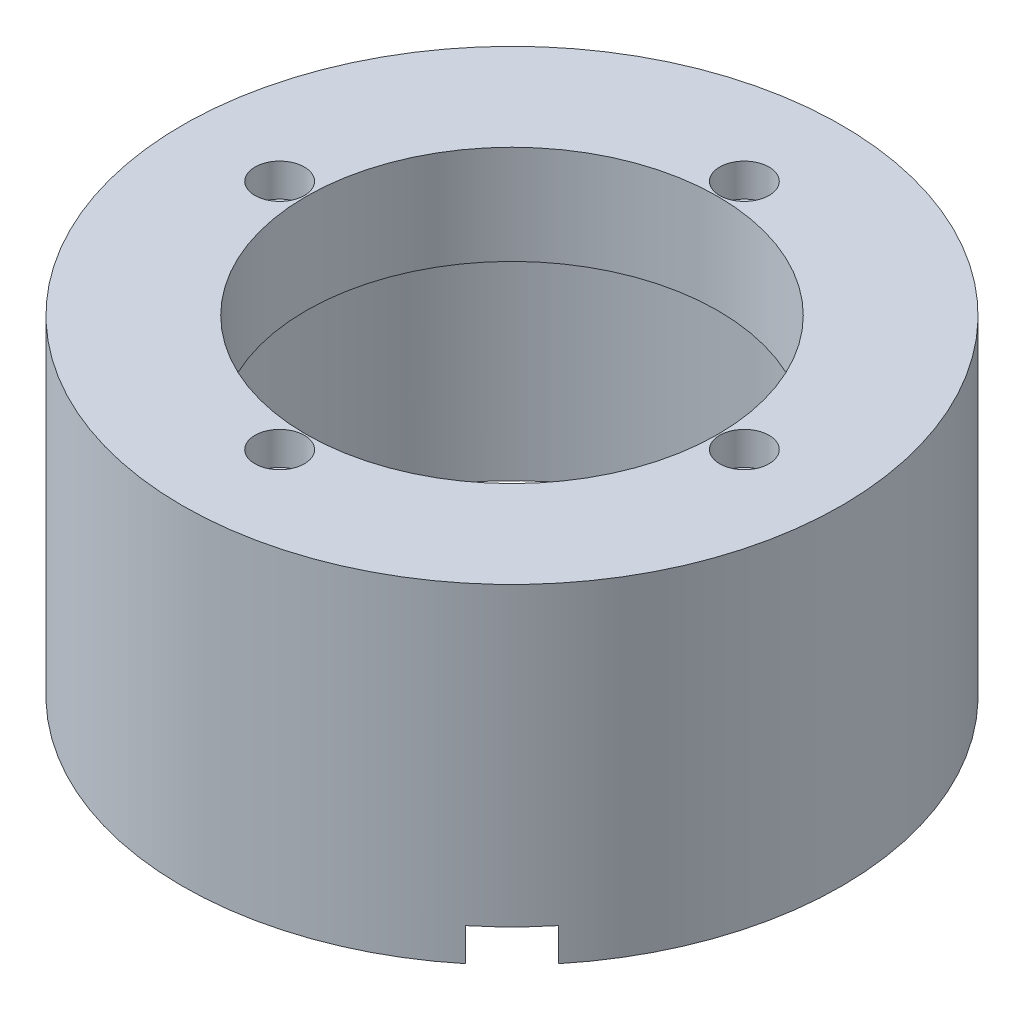
ISO-10303-21;
HEADER;
FILE_DESCRIPTION(('STEP AP214'),'2;1');
FILE_NAME('part.step','',(''),(''),'','','');
FILE_SCHEMA(('AUTOMOTIVE_DESIGN { 1 0 10303 214 1 1 1 1 }'));
ENDSEC;
DATA;
#1=APPLICATION_CONTEXT('core data for automotive mechanical design processes');
#2=APPLICATION_PROTOCOL_DEFINITION('international standard','automotive_design',2000,#1);
#3=PRODUCT_CONTEXT('',#1,'mechanical');
#4=PRODUCT('Part','Part','',(#3));
#5=PRODUCT_RELATED_PRODUCT_CATEGORY('part','',(#4));
#6=PRODUCT_DEFINITION_FORMATION('','',#4);
#7=PRODUCT_DEFINITION_CONTEXT('part definition',#1,'design');
#8=PRODUCT_DEFINITION('design','',#6,#7);
#9=PRODUCT_DEFINITION_SHAPE('','',#8);
#10=(LENGTH_UNIT() NAMED_UNIT(*) SI_UNIT(.MILLI.,.METRE.));
#11=(NAMED_UNIT(*) PLANE_ANGLE_UNIT() SI_UNIT($,.RADIAN.));
#12=(NAMED_UNIT(*) SI_UNIT($,.STERADIAN.) SOLID_ANGLE_UNIT());
#13=UNCERTAINTY_MEASURE_WITH_UNIT(LENGTH_MEASURE(1.E-05),#10,'distance_accuracy_value','');
#14=(GEOMETRIC_REPRESENTATION_CONTEXT(3) GLOBAL_UNCERTAINTY_ASSIGNED_CONTEXT((#13)) GLOBAL_UNIT_ASSIGNED_CONTEXT((#10,
#11,#12)) REPRESENTATION_CONTEXT('',''));
#15=CARTESIAN_POINT('',(0.,0.,0.));
#16=DIRECTION('',(0.,0.,1.));
#17=DIRECTION('',(1.,0.,0.));
#18=AXIS2_PLACEMENT_3D('',#15,#16,#17);
#19=CARTESIAN_POINT('',(0.,0.,0.));
#20=DIRECTION('',(0.,1.,0.));
#21=DIRECTION('',(0.,0.,1.));
#22=AXIS2_PLACEMENT_3D('',#19,#20,#21);
#23=PLANE('',#22);
#24=CARTESIAN_POINT('',(45.0000000000022,0.,2.25047696454651E-12));
#25=DIRECTION('',(0.,-1.,0.));
#26=DIRECTION('',(0.,0.,-1.));
#27=AXIS2_PLACEMENT_3D('',#24,#25,#26);
#28=CIRCLE('',#27,1.50000000000164);
#29=CARTESIAN_POINT('',(45.0000000000022,0.,-1.49999999999939));
#30=VERTEX_POINT('',#29);
#31=EDGE_CURVE('E144',#30,#30,#28,.T.);
#32=ORIENTED_EDGE('',*,*,#31,.F.);
#33=EDGE_LOOP('',(#32));
#34=FACE_BOUND('',#33,.T.);
#35=CARTESIAN_POINT('',(-44.9999999999977,0.,-2.25598787514267E-12));
#36=DIRECTION('',(0.,-1.,0.));
#37=DIRECTION('',(0.,0.,-1.));
#38=AXIS2_PLACEMENT_3D('',#35,#36,#37);
#39=CIRCLE('',#38,1.50000000000327);
#40=CARTESIAN_POINT('',(-44.9999999999977,0.,-1.50000000000552));
#41=VERTEX_POINT('',#40);
#42=EDGE_CURVE('E138',#41,#41,#39,.T.);
#43=ORIENTED_EDGE('',*,*,#42,.F.);
#44=EDGE_LOOP('',(#43));
#45=FACE_BOUND('',#44,.T.);
#46=CARTESIAN_POINT('',(0.,0.,45.));
#47=DIRECTION('',(0.,-1.,0.));
#48=DIRECTION('',(0.,0.,-1.));
#49=AXIS2_PLACEMENT_3D('',#46,#47,#48);
#50=CIRCLE('',#49,1.5);
#51=CARTESIAN_POINT('',(0.,0.,43.5));
#52=VERTEX_POINT('',#51);
#53=EDGE_CURVE('E132',#52,#52,#50,.T.);
#54=ORIENTED_EDGE('',*,*,#53,.F.);
#55=EDGE_LOOP('',(#54));
#56=FACE_BOUND('',#55,.T.);
#57=CARTESIAN_POINT('',(4.50095392909302E-12,0.,-45.));
#58=DIRECTION('',(0.,-1.,0.));
#59=DIRECTION('',(0.,0.,-1.));
#60=AXIS2_PLACEMENT_3D('',#57,#58,#59);
#61=CIRCLE('',#60,1.50000000000461);
#62=CARTESIAN_POINT('',(4.50095392909302E-12,0.,-46.5000000000046));
#63=VERTEX_POINT('',#62);
#64=EDGE_CURVE('E129',#63,#63,#61,.T.);
#65=ORIENTED_EDGE('',*,*,#64,.F.);
#66=EDGE_LOOP('',(#65));
#67=FACE_BOUND('',#66,.T.);
#68=DIRECTION('',(-0.707106781186546,0.,-0.707106781186549));
#69=VECTOR('',#68,1.);
#70=CARTESIAN_POINT('',(3.53553390593275,0.,-3.53553390593273));
#71=LINE('',#70,#69);
#72=CARTESIAN_POINT('',(38.7136521046084,0.,31.6425842927431));
#73=VERTEX_POINT('',#72);
#74=CARTESIAN_POINT('',(31.5979643067373,0.,24.5268964948719));
#75=VERTEX_POINT('',#74);
#76=EDGE_CURVE('E75',#73,#75,#71,.T.);
#77=ORIENTED_EDGE('',*,*,#76,.T.);
#78=CARTESIAN_POINT('',(0.,0.,0.));
#79=DIRECTION('',(0.,-1.,0.));
#80=DIRECTION('',(0.,0.,-1.));
#81=AXIS2_PLACEMENT_3D('',#78,#79,#80);
#82=CIRCLE('',#81,40.);
#83=CARTESIAN_POINT('',(24.5268964948718,0.,31.5979643067373));
#84=VERTEX_POINT('',#83);
#85=EDGE_CURVE('E128',#84,#75,#82,.T.);
#86=ORIENTED_EDGE('',*,*,#85,.F.);
#87=DIRECTION('',(-0.707106781186547,0.,-0.707106781186548));
#88=VECTOR('',#87,1.);
#89=CARTESIAN_POINT('',(-3.53553390593276,0.,3.53553390593275));
#90=LINE('',#89,#88);
#91=CARTESIAN_POINT('',(31.6425842927429,0.,38.7136521046085));
#92=VERTEX_POINT('',#91);
#93=EDGE_CURVE('E268',#92,#84,#90,.T.);
#94=ORIENTED_EDGE('',*,*,#93,.F.);
#95=CARTESIAN_POINT('',(0.,0.,0.));
#96=DIRECTION('',(0.,1.,0.));
#97=DIRECTION('',(0.,0.,1.));
#98=AXIS2_PLACEMENT_3D('',#95,#96,#97);
#99=CIRCLE('',#98,50.);
#100=EDGE_CURVE('E42',#73,#92,#99,.T.);
#101=ORIENTED_EDGE('',*,*,#100,.F.);
#102=EDGE_LOOP('',(#77,#86,#94,#101));
#103=FACE_BOUND('',#102,.T.);
#104=ADVANCED_FACE('F33',(#34,#45,#56,#67,#103),#23,.F.);
#105=CARTESIAN_POINT('',(0.,50.,0.));
#106=DIRECTION('',(0.,-1.,0.));
#107=DIRECTION('',(0.,0.,-1.));
#108=AXIS2_PLACEMENT_3D('',#105,#106,#107);
#109=CYLINDRICAL_SURFACE('',#108,50.);
#110=CARTESIAN_POINT('',(0.,50.,0.));
#111=DIRECTION('',(0.,1.,0.));
#112=DIRECTION('',(0.,0.,1.));
#113=AXIS2_PLACEMENT_3D('',#110,#111,#112);
#114=CIRCLE('',#113,50.);
#115=CARTESIAN_POINT('',(0.,50.,50.));
#116=VERTEX_POINT('',#115);
#117=EDGE_CURVE('E11',#116,#116,#114,.T.);
#118=ORIENTED_EDGE('',*,*,#117,.F.);
#119=EDGE_LOOP('',(#118));
#120=FACE_BOUND('',#119,.T.);
#121=DIRECTION('',(0.,-1.,0.));
#122=VECTOR('',#121,1.);
#123=CARTESIAN_POINT('',(38.7136521046084,5.,31.6425842927431));
#124=LINE('',#123,#122);
#125=CARTESIAN_POINT('',(38.7136521046084,5.,31.6425842927431));
#126=VERTEX_POINT('',#125);
#127=EDGE_CURVE('E59',#126,#73,#124,.T.);
#128=ORIENTED_EDGE('',*,*,#127,.T.);
#129=ORIENTED_EDGE('',*,*,#100,.T.);
#130=DIRECTION('',(0.,-1.,0.));
#131=VECTOR('',#130,1.);
#132=CARTESIAN_POINT('',(31.6425842927429,5.,38.7136521046085));
#133=LINE('',#132,#131);
#134=CARTESIAN_POINT('',(31.6425842927429,5.,38.7136521046085));
#135=VERTEX_POINT('',#134);
#136=EDGE_CURVE('E79',#135,#92,#133,.T.);
#137=ORIENTED_EDGE('',*,*,#136,.F.);
#138=CARTESIAN_POINT('',(0.,5.,0.));
#139=DIRECTION('',(0.,-1.,0.));
#140=DIRECTION('',(0.,0.,-1.));
#141=AXIS2_PLACEMENT_3D('',#138,#139,#140);
#142=CIRCLE('',#141,50.);
#143=EDGE_CURVE('E85',#126,#135,#142,.T.);
#144=ORIENTED_EDGE('',*,*,#143,.F.);
#145=EDGE_LOOP('',(#128,#129,#137,#144));
#146=FACE_BOUND('',#145,.T.);
#147=ADVANCED_FACE('F35',(#120,#146),#109,.T.);
#148=CARTESIAN_POINT('',(0.,35.,0.));
#149=DIRECTION('',(0.,-1.,0.));
#150=DIRECTION('',(0.,0.,-1.));
#151=AXIS2_PLACEMENT_3D('',#148,#149,#150);
#152=CYLINDRICAL_SURFACE('',#151,40.);
#153=CARTESIAN_POINT('',(0.,35.,0.));
#154=DIRECTION('',(0.,-1.,0.));
#155=DIRECTION('',(0.,0.,-1.));
#156=AXIS2_PLACEMENT_3D('',#153,#154,#155);
#157=CIRCLE('',#156,40.);
#158=CARTESIAN_POINT('',(0.,35.,-40.));
#159=VERTEX_POINT('',#158);
#160=EDGE_CURVE('E151',#159,#159,#157,.T.);
#161=ORIENTED_EDGE('',*,*,#160,.F.);
#162=EDGE_LOOP('',(#161));
#163=FACE_BOUND('',#162,.T.);
#164=DIRECTION('',(0.,-1.,0.));
#165=VECTOR('',#164,1.);
#166=CARTESIAN_POINT('',(31.5979643067373,5.,24.5268964948719));
#167=LINE('',#166,#165);
#168=CARTESIAN_POINT('',(31.5979643067373,5.,24.5268964948719));
#169=VERTEX_POINT('',#168);
#170=EDGE_CURVE('E95',#169,#75,#167,.T.);
#171=ORIENTED_EDGE('',*,*,#170,.F.);
#172=CARTESIAN_POINT('',(0.,5.,0.));
#173=DIRECTION('',(0.,-1.,0.));
#174=DIRECTION('',(0.,0.,-1.));
#175=AXIS2_PLACEMENT_3D('',#172,#173,#174);
#176=CIRCLE('',#175,40.);
#177=CARTESIAN_POINT('',(24.5268964948718,5.,31.5979643067373));
#178=VERTEX_POINT('',#177);
#179=EDGE_CURVE('E84',#178,#169,#176,.F.);
#180=ORIENTED_EDGE('',*,*,#179,.F.);
#181=DIRECTION('',(0.,-1.,0.));
#182=VECTOR('',#181,1.);
#183=CARTESIAN_POINT('',(24.5268964948718,5.,31.5979643067373));
#184=LINE('',#183,#182);
#185=EDGE_CURVE('E82',#178,#84,#184,.T.);
#186=ORIENTED_EDGE('',*,*,#185,.T.);
#187=ORIENTED_EDGE('',*,*,#85,.T.);
#188=EDGE_LOOP('',(#171,#180,#186,#187));
#189=FACE_BOUND('',#188,.T.);
#190=ADVANCED_FACE('F190',(#163,#189),#152,.F.);
#191=CARTESIAN_POINT('',(-35.2499999999977,50.,-2.25419682919892E-12));
#192=DIRECTION('',(0.,-1.,0.));
#193=DIRECTION('',(0.,0.,-1.));
#194=AXIS2_PLACEMENT_3D('',#191,#192,#193);
#195=CYLINDRICAL_SURFACE('',#194,2.00000000000317);
#196=CARTESIAN_POINT('',(-35.2499999999977,35.,-2.25419682919892E-12));
#197=DIRECTION('',(0.,-1.,0.));
#198=DIRECTION('',(0.,0.,-1.));
#199=AXIS2_PLACEMENT_3D('',#196,#197,#198);
#200=CIRCLE('',#199,2.00000000000317);
#201=CARTESIAN_POINT('',(-35.2499999999977,35.,-2.00000000000542));
#202=VERTEX_POINT('',#201);
#203=EDGE_CURVE('E163',#202,#202,#200,.T.);
#204=ORIENTED_EDGE('',*,*,#203,.T.);
#205=EDGE_LOOP('',(#204));
#206=FACE_BOUND('',#205,.T.);
#207=CARTESIAN_POINT('',(-35.2499999999977,45.,-2.25419682919892E-12));
#208=DIRECTION('',(0.,1.,0.));
#209=DIRECTION('',(0.,0.,1.));
#210=AXIS2_PLACEMENT_3D('',#207,#208,#209);
#211=CIRCLE('',#210,2.00000000000317);
#212=CARTESIAN_POINT('',(-35.2499999999977,45.,2.00000000000091));
#213=VERTEX_POINT('',#212);
#214=EDGE_CURVE('E37',#213,#213,#211,.F.);
#215=ORIENTED_EDGE('',*,*,#214,.F.);
#216=EDGE_LOOP('',(#215));
#217=FACE_BOUND('',#216,.T.);
#218=ADVANCED_FACE('F187',(#206,#217),#195,.F.);
#219=CARTESIAN_POINT('',(4.49975989846385E-12,50.,-35.25));
#220=DIRECTION('',(0.,-1.,0.));
#221=DIRECTION('',(0.,0.,-1.));
#222=AXIS2_PLACEMENT_3D('',#219,#220,#221);
#223=CYLINDRICAL_SURFACE('',#222,2.00000000000454);
#224=CARTESIAN_POINT('',(4.49975989846385E-12,35.,-35.25));
#225=DIRECTION('',(0.,-1.,0.));
#226=DIRECTION('',(0.,0.,-1.));
#227=AXIS2_PLACEMENT_3D('',#224,#225,#226);
#228=CIRCLE('',#227,2.00000000000454);
#229=CARTESIAN_POINT('',(4.49975989846385E-12,35.,-37.2500000000045));
#230=VERTEX_POINT('',#229);
#231=EDGE_CURVE('E166',#230,#230,#228,.T.);
#232=ORIENTED_EDGE('',*,*,#231,.T.);
#233=EDGE_LOOP('',(#232));
#234=FACE_BOUND('',#233,.T.);
#235=CARTESIAN_POINT('',(4.49975989846385E-12,45.,-35.25));
#236=DIRECTION('',(0.,1.,0.));
#237=DIRECTION('',(0.,0.,1.));
#238=AXIS2_PLACEMENT_3D('',#235,#236,#237);
#239=CIRCLE('',#238,2.00000000000454);
#240=CARTESIAN_POINT('',(4.49975989846385E-12,45.,-33.2499999999955));
#241=VERTEX_POINT('',#240);
#242=EDGE_CURVE('E178',#241,#241,#239,.F.);
#243=ORIENTED_EDGE('',*,*,#242,.F.);
#244=EDGE_LOOP('',(#243));
#245=FACE_BOUND('',#244,.T.);
#246=ADVANCED_FACE('F189',(#234,#245),#223,.F.);
#247=CARTESIAN_POINT('',(35.2500000000022,50.,2.24987994923192E-12));
#248=DIRECTION('',(0.,-1.,0.));
#249=DIRECTION('',(0.,0.,-1.));
#250=AXIS2_PLACEMENT_3D('',#247,#248,#249);
#251=CYLINDRICAL_SURFACE('',#250,2.00000000000161);
#252=CARTESIAN_POINT('',(35.2500000000022,35.,2.24987994923192E-12));
#253=DIRECTION('',(0.,-1.,0.));
#254=DIRECTION('',(0.,0.,-1.));
#255=AXIS2_PLACEMENT_3D('',#252,#253,#254);
#256=CIRCLE('',#255,2.00000000000161);
#257=CARTESIAN_POINT('',(35.2500000000022,35.,-1.99999999999936));
#258=VERTEX_POINT('',#257);
#259=EDGE_CURVE('E169',#258,#258,#256,.T.);
#260=ORIENTED_EDGE('',*,*,#259,.T.);
#261=EDGE_LOOP('',(#260));
#262=FACE_BOUND('',#261,.T.);
#263=CARTESIAN_POINT('',(35.2500000000022,45.,2.24987994923192E-12));
#264=DIRECTION('',(0.,1.,0.));
#265=DIRECTION('',(0.,0.,1.));
#266=AXIS2_PLACEMENT_3D('',#263,#264,#265);
#267=CIRCLE('',#266,2.00000000000161);
#268=CARTESIAN_POINT('',(35.2500000000022,45.,2.00000000000386));
#269=VERTEX_POINT('',#268);
#270=EDGE_CURVE('E176',#269,#269,#267,.F.);
#271=ORIENTED_EDGE('',*,*,#270,.F.);
#272=EDGE_LOOP('',(#271));
#273=FACE_BOUND('',#272,.T.);
#274=ADVANCED_FACE('F197',(#262,#273),#251,.F.);
#275=CARTESIAN_POINT('',(0.,50.,35.25));
#276=DIRECTION('',(0.,-1.,0.));
#277=DIRECTION('',(0.,0.,-1.));
#278=AXIS2_PLACEMENT_3D('',#275,#276,#277);
#279=CYLINDRICAL_SURFACE('',#278,2.);
#280=CARTESIAN_POINT('',(0.,35.,35.25));
#281=DIRECTION('',(0.,-1.,0.));
#282=DIRECTION('',(0.,0.,-1.));
#283=AXIS2_PLACEMENT_3D('',#280,#281,#282);
#284=CIRCLE('',#283,2.);
#285=CARTESIAN_POINT('',(0.,35.,33.25));
#286=VERTEX_POINT('',#285);
#287=EDGE_CURVE('E150',#286,#286,#284,.T.);
#288=ORIENTED_EDGE('',*,*,#287,.T.);
#289=EDGE_LOOP('',(#288));
#290=FACE_BOUND('',#289,.T.);
#291=CARTESIAN_POINT('',(0.,45.,35.25));
#292=DIRECTION('',(0.,1.,0.));
#293=DIRECTION('',(0.,0.,1.));
#294=AXIS2_PLACEMENT_3D('',#291,#292,#293);
#295=CIRCLE('',#294,2.);
#296=CARTESIAN_POINT('',(0.,45.,37.25));
#297=VERTEX_POINT('',#296);
#298=EDGE_CURVE('E103',#297,#297,#295,.F.);
#299=ORIENTED_EDGE('',*,*,#298,.F.);
#300=EDGE_LOOP('',(#299));
#301=FACE_BOUND('',#300,.T.);
#302=ADVANCED_FACE('F219',(#290,#301),#279,.F.);
#303=CARTESIAN_POINT('',(0.,50.,0.));
#304=DIRECTION('',(0.,-1.,0.));
#305=DIRECTION('',(0.,0.,-1.));
#306=AXIS2_PLACEMENT_3D('',#303,#304,#305);
#307=CYLINDRICAL_SURFACE('',#306,31.25);
#308=CARTESIAN_POINT('',(0.,50.,0.));
#309=DIRECTION('',(0.,1.,0.));
#310=DIRECTION('',(0.,0.,1.));
#311=AXIS2_PLACEMENT_3D('',#308,#309,#310);
#312=CIRCLE('',#311,31.25);
#313=CARTESIAN_POINT('',(0.,50.,31.25));
#314=VERTEX_POINT('',#313);
#315=EDGE_CURVE('E157',#314,#314,#312,.T.);
#316=ORIENTED_EDGE('',*,*,#315,.T.);
#317=EDGE_LOOP('',(#316));
#318=FACE_BOUND('',#317,.T.);
#319=CARTESIAN_POINT('',(0.,35.,0.));
#320=DIRECTION('',(0.,-1.,0.));
#321=DIRECTION('',(0.,0.,-1.));
#322=AXIS2_PLACEMENT_3D('',#319,#320,#321);
#323=CIRCLE('',#322,31.25);
#324=CARTESIAN_POINT('',(0.,35.,-31.25));
#325=VERTEX_POINT('',#324);
#326=EDGE_CURVE('E154',#325,#325,#323,.T.);
#327=ORIENTED_EDGE('',*,*,#326,.T.);
#328=EDGE_LOOP('',(#327));
#329=FACE_BOUND('',#328,.T.);
#330=ADVANCED_FACE('F216',(#318,#329),#307,.F.);
#331=CARTESIAN_POINT('',(0.,50.,0.));
#332=DIRECTION('',(0.,1.,0.));
#333=DIRECTION('',(0.,0.,1.));
#334=AXIS2_PLACEMENT_3D('',#331,#332,#333);
#335=PLANE('',#334);
#336=CARTESIAN_POINT('',(4.49975989846385E-12,50.,-35.25));
#337=DIRECTION('',(0.,1.,0.));
#338=DIRECTION('',(0.,0.,1.));
#339=AXIS2_PLACEMENT_3D('',#336,#337,#338);
#340=CIRCLE('',#339,3.75);
#341=CARTESIAN_POINT('',(4.49975989846385E-12,50.,-31.5));
#342=VERTEX_POINT('',#341);
#343=EDGE_CURVE('E104',#342,#342,#340,.T.);
#344=ORIENTED_EDGE('',*,*,#343,.F.);
#345=EDGE_LOOP('',(#344));
#346=FACE_BOUND('',#345,.T.);
#347=CARTESIAN_POINT('',(35.250000000001,50.,3.51084528094309E-12));
#348=DIRECTION('',(0.,1.,0.));
#349=DIRECTION('',(0.,0.,1.));
#350=AXIS2_PLACEMENT_3D('',#347,#348,#349);
#351=CIRCLE('',#350,3.75000000000078);
#352=CARTESIAN_POINT('',(35.250000000001,50.,3.75000000000429));
#353=VERTEX_POINT('',#352);
#354=EDGE_CURVE('E110',#353,#353,#351,.T.);
#355=ORIENTED_EDGE('',*,*,#354,.F.);
#356=EDGE_LOOP('',(#355));
#357=FACE_BOUND('',#356,.T.);
#358=CARTESIAN_POINT('',(-2.52193066342233E-12,50.,35.25));
#359=DIRECTION('',(0.,1.,0.));
#360=DIRECTION('',(0.,0.,1.));
#361=AXIS2_PLACEMENT_3D('',#358,#359,#360);
#362=CIRCLE('',#361,3.75000000000213);
#363=CARTESIAN_POINT('',(-2.52193066342233E-12,50.,39.0000000000021));
#364=VERTEX_POINT('',#363);
#365=EDGE_CURVE('E116',#364,#364,#362,.T.);
#366=ORIENTED_EDGE('',*,*,#365,.F.);
#367=EDGE_LOOP('',(#366));
#368=FACE_BOUND('',#367,.T.);
#369=CARTESIAN_POINT('',(-35.249999999999,50.,-3.50652840097609E-12));
#370=DIRECTION('',(0.,1.,0.));
#371=DIRECTION('',(0.,0.,1.));
#372=AXIS2_PLACEMENT_3D('',#369,#370,#371);
#373=CIRCLE('',#372,3.7500000000016);
#374=CARTESIAN_POINT('',(-35.249999999999,50.,3.74999999999809));
#375=VERTEX_POINT('',#374);
#376=EDGE_CURVE('E122',#375,#375,#373,.T.);
#377=ORIENTED_EDGE('',*,*,#376,.F.);
#378=EDGE_LOOP('',(#377));
#379=FACE_BOUND('',#378,.T.);
#380=ORIENTED_EDGE('',*,*,#117,.T.);
#381=EDGE_LOOP('',(#380));
#382=FACE_BOUND('',#381,.T.);
#383=ORIENTED_EDGE('',*,*,#315,.F.);
#384=EDGE_LOOP('',(#383));
#385=FACE_BOUND('',#384,.T.);
#386=ADVANCED_FACE('F212',(#346,#357,#368,#379,#382,#385),#335,.T.);
#387=CARTESIAN_POINT('',(0.,35.,0.));
#388=DIRECTION('',(0.,-1.,0.));
#389=DIRECTION('',(0.,0.,-1.));
#390=AXIS2_PLACEMENT_3D('',#387,#388,#389);
#391=PLANE('',#390);
#392=ORIENTED_EDGE('',*,*,#287,.F.);
#393=EDGE_LOOP('',(#392));
#394=FACE_BOUND('',#393,.T.);
#395=ORIENTED_EDGE('',*,*,#259,.F.);
#396=EDGE_LOOP('',(#395));
#397=FACE_BOUND('',#396,.T.);
#398=ORIENTED_EDGE('',*,*,#231,.F.);
#399=EDGE_LOOP('',(#398));
#400=FACE_BOUND('',#399,.T.);
#401=ORIENTED_EDGE('',*,*,#203,.F.);
#402=EDGE_LOOP('',(#401));
#403=FACE_BOUND('',#402,.T.);
#404=ORIENTED_EDGE('',*,*,#326,.F.);
#405=EDGE_LOOP('',(#404));
#406=FACE_BOUND('',#405,.T.);
#407=ORIENTED_EDGE('',*,*,#160,.T.);
#408=EDGE_LOOP('',(#407));
#409=FACE_BOUND('',#408,.T.);
#410=ADVANCED_FACE('F215',(#394,#397,#400,#403,#406,#409),#391,.T.);
#411=CARTESIAN_POINT('',(45.0000000000022,35.,2.25047696454651E-12));
#412=DIRECTION('',(0.,-1.,0.));
#413=DIRECTION('',(0.,0.,-1.));
#414=AXIS2_PLACEMENT_3D('',#411,#412,#413);
#415=CYLINDRICAL_SURFACE('',#414,1.50000000000164);
#416=CARTESIAN_POINT('',(45.0000000000022,35.,2.25047696454651E-12));
#417=DIRECTION('',(0.,-1.,0.));
#418=DIRECTION('',(0.,0.,-1.));
#419=AXIS2_PLACEMENT_3D('',#416,#417,#418);
#420=CIRCLE('',#419,1.50000000000164);
#421=CARTESIAN_POINT('',(45.0000000000022,35.,-1.49999999999939));
#422=VERTEX_POINT('',#421);
#423=EDGE_CURVE('E147',#422,#422,#420,.T.);
#424=ORIENTED_EDGE('',*,*,#423,.F.);
#425=EDGE_LOOP('',(#424));
#426=FACE_BOUND('',#425,.T.);
#427=ORIENTED_EDGE('',*,*,#31,.T.);
#428=EDGE_LOOP('',(#427));
#429=FACE_BOUND('',#428,.T.);
#430=ADVANCED_FACE('F224',(#426,#429),#415,.F.);
#431=CARTESIAN_POINT('',(45.0000000000022,35.,2.25047696454651E-12));
#432=DIRECTION('',(0.,-1.,0.));
#433=DIRECTION('',(0.,0.,-1.));
#434=AXIS2_PLACEMENT_3D('',#431,#432,#433);
#435=PLANE('',#434);
#436=ORIENTED_EDGE('',*,*,#423,.T.);
#437=EDGE_LOOP('',(#436));
#438=FACE_BOUND('',#437,.T.);
#439=ADVANCED_FACE('F226',(#438),#435,.T.);
#440=CARTESIAN_POINT('',(-44.9999999999977,35.,-2.25598787514267E-12));
#441=DIRECTION('',(0.,-1.,0.));
#442=DIRECTION('',(0.,0.,-1.));
#443=AXIS2_PLACEMENT_3D('',#440,#441,#442);
#444=CYLINDRICAL_SURFACE('',#443,1.50000000000327);
#445=CARTESIAN_POINT('',(-44.9999999999977,35.,-2.25598787514267E-12));
#446=DIRECTION('',(0.,-1.,0.));
#447=DIRECTION('',(0.,0.,-1.));
#448=AXIS2_PLACEMENT_3D('',#445,#446,#447);
#449=CIRCLE('',#448,1.50000000000327);
#450=CARTESIAN_POINT('',(-44.9999999999977,35.,-1.50000000000552));
#451=VERTEX_POINT('',#450);
#452=EDGE_CURVE('E141',#451,#451,#449,.T.);
#453=ORIENTED_EDGE('',*,*,#452,.F.);
#454=EDGE_LOOP('',(#453));
#455=FACE_BOUND('',#454,.T.);
#456=ORIENTED_EDGE('',*,*,#42,.T.);
#457=EDGE_LOOP('',(#456));
#458=FACE_BOUND('',#457,.T.);
#459=ADVANCED_FACE('F229',(#455,#458),#444,.F.);
#460=CARTESIAN_POINT('',(-44.9999999999977,35.,-2.25598787514267E-12));
#461=DIRECTION('',(0.,-1.,0.));
#462=DIRECTION('',(0.,0.,-1.));
#463=AXIS2_PLACEMENT_3D('',#460,#461,#462);
#464=PLANE('',#463);
#465=ORIENTED_EDGE('',*,*,#452,.T.);
#466=EDGE_LOOP('',(#465));
#467=FACE_BOUND('',#466,.T.);
#468=ADVANCED_FACE('F234',(#467),#464,.T.);
#469=CARTESIAN_POINT('',(0.,35.,45.));
#470=DIRECTION('',(0.,-1.,0.));
#471=DIRECTION('',(0.,0.,-1.));
#472=AXIS2_PLACEMENT_3D('',#469,#470,#471);
#473=CYLINDRICAL_SURFACE('',#472,1.5);
#474=CARTESIAN_POINT('',(0.,35.,45.));
#475=DIRECTION('',(0.,-1.,0.));
#476=DIRECTION('',(0.,0.,-1.));
#477=AXIS2_PLACEMENT_3D('',#474,#475,#476);
#478=CIRCLE('',#477,1.5);
#479=CARTESIAN_POINT('',(0.,35.,43.5));
#480=VERTEX_POINT('',#479);
#481=EDGE_CURVE('E135',#480,#480,#478,.T.);
#482=ORIENTED_EDGE('',*,*,#481,.F.);
#483=EDGE_LOOP('',(#482));
#484=FACE_BOUND('',#483,.T.);
#485=ORIENTED_EDGE('',*,*,#53,.T.);
#486=EDGE_LOOP('',(#485));
#487=FACE_BOUND('',#486,.T.);
#488=ADVANCED_FACE('F237',(#484,#487),#473,.F.);
#489=CARTESIAN_POINT('',(0.,35.,0.));
#490=DIRECTION('',(0.,-1.,0.));
#491=DIRECTION('',(0.,0.,-1.));
#492=AXIS2_PLACEMENT_3D('',#489,#490,#491);
#493=PLANE('',#492);
#494=ORIENTED_EDGE('',*,*,#481,.T.);
#495=EDGE_LOOP('',(#494));
#496=FACE_BOUND('',#495,.T.);
#497=ADVANCED_FACE('F242',(#496),#493,.T.);
#498=CARTESIAN_POINT('',(4.50095392909302E-12,35.,-45.));
#499=DIRECTION('',(0.,-1.,0.));
#500=DIRECTION('',(0.,0.,-1.));
#501=AXIS2_PLACEMENT_3D('',#498,#499,#500);
#502=CYLINDRICAL_SURFACE('',#501,1.50000000000461);
#503=CARTESIAN_POINT('',(4.50095392909302E-12,35.,-45.));
#504=DIRECTION('',(0.,-1.,0.));
#505=DIRECTION('',(0.,0.,-1.));
#506=AXIS2_PLACEMENT_3D('',#503,#504,#505);
#507=CIRCLE('',#506,1.50000000000461);
#508=CARTESIAN_POINT('',(4.50095392909302E-12,35.,-46.5000000000046));
#509=VERTEX_POINT('',#508);
#510=EDGE_CURVE('E125',#509,#509,#507,.T.);
#511=ORIENTED_EDGE('',*,*,#510,.F.);
#512=EDGE_LOOP('',(#511));
#513=FACE_BOUND('',#512,.T.);
#514=ORIENTED_EDGE('',*,*,#64,.T.);
#515=EDGE_LOOP('',(#514));
#516=FACE_BOUND('',#515,.T.);
#517=ADVANCED_FACE('F245',(#513,#516),#502,.F.);
#518=CARTESIAN_POINT('',(0.,35.,0.));
#519=DIRECTION('',(0.,-1.,0.));
#520=DIRECTION('',(0.,0.,-1.));
#521=AXIS2_PLACEMENT_3D('',#518,#519,#520);
#522=PLANE('',#521);
#523=ORIENTED_EDGE('',*,*,#510,.T.);
#524=EDGE_LOOP('',(#523));
#525=FACE_BOUND('',#524,.T.);
#526=ADVANCED_FACE('F251',(#525),#522,.T.);
#527=CARTESIAN_POINT('',(-2.52193066342233E-12,45.,35.25));
#528=DIRECTION('',(0.,1.,0.));
#529=DIRECTION('',(0.,0.,1.));
#530=AXIS2_PLACEMENT_3D('',#527,#528,#529);
#531=PLANE('',#530);
#532=CARTESIAN_POINT('',(-2.52193066342233E-12,45.,35.25));
#533=DIRECTION('',(0.,1.,0.));
#534=DIRECTION('',(0.,0.,1.));
#535=AXIS2_PLACEMENT_3D('',#532,#533,#534);
#536=CIRCLE('',#535,3.75000000000213);
#537=CARTESIAN_POINT('',(-2.52193066342233E-12,45.,39.0000000000021));
#538=VERTEX_POINT('',#537);
#539=EDGE_CURVE('E113',#538,#538,#536,.T.);
#540=ORIENTED_EDGE('',*,*,#539,.T.);
#541=EDGE_LOOP('',(#540));
#542=FACE_BOUND('',#541,.T.);
#543=ORIENTED_EDGE('',*,*,#298,.T.);
#544=EDGE_LOOP('',(#543));
#545=FACE_BOUND('',#544,.T.);
#546=ADVANCED_FACE('F254',(#542,#545),#531,.T.);
#547=CARTESIAN_POINT('',(-2.52193066342233E-12,45.,35.25));
#548=DIRECTION('',(0.,1.,0.));
#549=DIRECTION('',(0.,0.,1.));
#550=AXIS2_PLACEMENT_3D('',#547,#548,#549);
#551=CYLINDRICAL_SURFACE('',#550,3.75000000000213);
#552=ORIENTED_EDGE('',*,*,#539,.F.);
#553=EDGE_LOOP('',(#552));
#554=FACE_BOUND('',#553,.T.);
#555=ORIENTED_EDGE('',*,*,#365,.T.);
#556=EDGE_LOOP('',(#555));
#557=FACE_BOUND('',#556,.T.);
#558=ADVANCED_FACE('F259',(#554,#557),#551,.F.);
#559=CARTESIAN_POINT('',(35.250000000001,45.,3.51084528094309E-12));
#560=DIRECTION('',(0.,1.,0.));
#561=DIRECTION('',(0.,0.,1.));
#562=AXIS2_PLACEMENT_3D('',#559,#560,#561);
#563=PLANE('',#562);
#564=CARTESIAN_POINT('',(35.250000000001,45.,3.51084528094309E-12));
#565=DIRECTION('',(0.,1.,0.));
#566=DIRECTION('',(0.,0.,1.));
#567=AXIS2_PLACEMENT_3D('',#564,#565,#566);
#568=CIRCLE('',#567,3.75000000000078);
#569=CARTESIAN_POINT('',(35.250000000001,45.,3.75000000000429));
#570=VERTEX_POINT('',#569);
#571=EDGE_CURVE('E107',#570,#570,#568,.T.);
#572=ORIENTED_EDGE('',*,*,#571,.T.);
#573=EDGE_LOOP('',(#572));
#574=FACE_BOUND('',#573,.T.);
#575=ORIENTED_EDGE('',*,*,#270,.T.);
#576=EDGE_LOOP('',(#575));
#577=FACE_BOUND('',#576,.T.);
#578=ADVANCED_FACE('F297',(#574,#577),#563,.T.);
#579=CARTESIAN_POINT('',(35.250000000001,45.,3.51084528094309E-12));
#580=DIRECTION('',(0.,1.,0.));
#581=DIRECTION('',(0.,0.,1.));
#582=AXIS2_PLACEMENT_3D('',#579,#580,#581);
#583=CYLINDRICAL_SURFACE('',#582,3.75000000000078);
#584=ORIENTED_EDGE('',*,*,#571,.F.);
#585=EDGE_LOOP('',(#584));
#586=FACE_BOUND('',#585,.T.);
#587=ORIENTED_EDGE('',*,*,#354,.T.);
#588=EDGE_LOOP('',(#587));
#589=FACE_BOUND('',#588,.T.);
#590=ADVANCED_FACE('F292',(#586,#589),#583,.F.);
#591=CARTESIAN_POINT('',(4.49975989846385E-12,45.,-35.25));
#592=DIRECTION('',(0.,1.,0.));
#593=DIRECTION('',(0.,0.,1.));
#594=AXIS2_PLACEMENT_3D('',#591,#592,#593);
#595=PLANE('',#594);
#596=CARTESIAN_POINT('',(4.49975989846385E-12,45.,-35.25));
#597=DIRECTION('',(0.,1.,0.));
#598=DIRECTION('',(0.,0.,1.));
#599=AXIS2_PLACEMENT_3D('',#596,#597,#598);
#600=CIRCLE('',#599,3.75);
#601=CARTESIAN_POINT('',(4.49975989846385E-12,45.,-31.5));
#602=VERTEX_POINT('',#601);
#603=EDGE_CURVE('E100',#602,#602,#600,.T.);
#604=ORIENTED_EDGE('',*,*,#603,.T.);
#605=EDGE_LOOP('',(#604));
#606=FACE_BOUND('',#605,.T.);
#607=ORIENTED_EDGE('',*,*,#242,.T.);
#608=EDGE_LOOP('',(#607));
#609=FACE_BOUND('',#608,.T.);
#610=ADVANCED_FACE('F288',(#606,#609),#595,.T.);
#611=CARTESIAN_POINT('',(4.49975989846385E-12,45.,-35.25));
#612=DIRECTION('',(0.,1.,0.));
#613=DIRECTION('',(0.,0.,1.));
#614=AXIS2_PLACEMENT_3D('',#611,#612,#613);
#615=CYLINDRICAL_SURFACE('',#614,3.75);
#616=ORIENTED_EDGE('',*,*,#603,.F.);
#617=EDGE_LOOP('',(#616));
#618=FACE_BOUND('',#617,.T.);
#619=ORIENTED_EDGE('',*,*,#343,.T.);
#620=EDGE_LOOP('',(#619));
#621=FACE_BOUND('',#620,.T.);
#622=ADVANCED_FACE('F291',(#618,#621),#615,.F.);
#623=CARTESIAN_POINT('',(-35.249999999999,45.,-3.50652840097609E-12));
#624=DIRECTION('',(0.,1.,0.));
#625=DIRECTION('',(0.,0.,1.));
#626=AXIS2_PLACEMENT_3D('',#623,#624,#625);
#627=PLANE('',#626);
#628=CARTESIAN_POINT('',(-35.249999999999,45.,-3.50652840097609E-12));
#629=DIRECTION('',(0.,1.,0.));
#630=DIRECTION('',(0.,0.,1.));
#631=AXIS2_PLACEMENT_3D('',#628,#629,#630);
#632=CIRCLE('',#631,3.7500000000016);
#633=CARTESIAN_POINT('',(-35.249999999999,45.,3.74999999999809));
#634=VERTEX_POINT('',#633);
#635=EDGE_CURVE('E119',#634,#634,#632,.T.);
#636=ORIENTED_EDGE('',*,*,#635,.T.);
#637=EDGE_LOOP('',(#636));
#638=FACE_BOUND('',#637,.T.);
#639=ORIENTED_EDGE('',*,*,#214,.T.);
#640=EDGE_LOOP('',(#639));
#641=FACE_BOUND('',#640,.T.);
#642=ADVANCED_FACE('F185',(#638,#641),#627,.T.);
#643=CARTESIAN_POINT('',(-35.249999999999,45.,-3.50652840097609E-12));
#644=DIRECTION('',(0.,1.,0.));
#645=DIRECTION('',(0.,0.,1.));
#646=AXIS2_PLACEMENT_3D('',#643,#644,#645);
#647=CYLINDRICAL_SURFACE('',#646,3.7500000000016);
#648=ORIENTED_EDGE('',*,*,#635,.F.);
#649=EDGE_LOOP('',(#648));
#650=FACE_BOUND('',#649,.T.);
#651=ORIENTED_EDGE('',*,*,#376,.T.);
#652=EDGE_LOOP('',(#651));
#653=FACE_BOUND('',#652,.T.);
#654=ADVANCED_FACE('F277',(#650,#653),#647,.F.);
#655=CARTESIAN_POINT('',(3.53553390593275,5.,-3.53553390593273));
#656=DIRECTION('',(-0.707106781186549,0.,0.707106781186546));
#657=DIRECTION('',(0.707106781186546,0.,0.707106781186549));
#658=AXIS2_PLACEMENT_3D('',#655,#656,#657);
#659=PLANE('',#658);
#660=ORIENTED_EDGE('',*,*,#76,.F.);
#661=ORIENTED_EDGE('',*,*,#127,.F.);
#662=DIRECTION('',(-0.707106781186546,0.,-0.707106781186549));
#663=VECTOR('',#662,1.);
#664=CARTESIAN_POINT('',(3.53553390593275,5.,-3.53553390593273));
#665=LINE('',#664,#663);
#666=EDGE_CURVE('E89',#126,#169,#665,.T.);
#667=ORIENTED_EDGE('',*,*,#666,.T.);
#668=ORIENTED_EDGE('',*,*,#170,.T.);
#669=EDGE_LOOP('',(#660,#661,#667,#668));
#670=FACE_BOUND('',#669,.T.);
#671=ADVANCED_FACE('F275',(#670),#659,.T.);
#672=CARTESIAN_POINT('',(-3.53553390593276,5.,3.53553390593275));
#673=DIRECTION('',(-0.707106781186548,0.,0.707106781186547));
#674=DIRECTION('',(0.707106781186547,0.,0.707106781186548));
#675=AXIS2_PLACEMENT_3D('',#672,#673,#674);
#676=PLANE('',#675);
#677=ORIENTED_EDGE('',*,*,#93,.T.);
#678=ORIENTED_EDGE('',*,*,#185,.F.);
#679=DIRECTION('',(-0.707106781186547,0.,-0.707106781186548));
#680=VECTOR('',#679,1.);
#681=CARTESIAN_POINT('',(-3.53553390593276,5.,3.53553390593275));
#682=LINE('',#681,#680);
#683=EDGE_CURVE('E50',#135,#178,#682,.T.);
#684=ORIENTED_EDGE('',*,*,#683,.F.);
#685=ORIENTED_EDGE('',*,*,#136,.T.);
#686=EDGE_LOOP('',(#677,#678,#684,#685));
#687=FACE_BOUND('',#686,.T.);
#688=ADVANCED_FACE('F77',(#687),#676,.F.);
#689=CARTESIAN_POINT('',(0.,5.,0.));
#690=DIRECTION('',(0.,-1.,0.));
#691=DIRECTION('',(0.,0.,-1.));
#692=AXIS2_PLACEMENT_3D('',#689,#690,#691);
#693=PLANE('',#692);
#694=ORIENTED_EDGE('',*,*,#143,.T.);
#695=ORIENTED_EDGE('',*,*,#683,.T.);
#696=ORIENTED_EDGE('',*,*,#179,.T.);
#697=ORIENTED_EDGE('',*,*,#666,.F.);
#698=EDGE_LOOP('',(#694,#695,#696,#697));
#699=FACE_BOUND('',#698,.T.);
#700=ADVANCED_FACE('F88',(#699),#693,.T.);
#701=CLOSED_SHELL('',(#104,#147,#190,#218,#246,#274,#302,#330,#386,#410,#430,#439,#459,#468,
#488,#497,#517,#526,#546,#558,#578,#590,#610,#622,#642,#654,#671,#688,#700));
#702=MANIFOLD_SOLID_BREP('B2',#701);
#703=ADVANCED_BREP_SHAPE_REPRESENTATION('',(#18,#702),#14);
#704=SHAPE_DEFINITION_REPRESENTATION(#9,#703);
ENDSEC;
END-ISO-10303-21;
